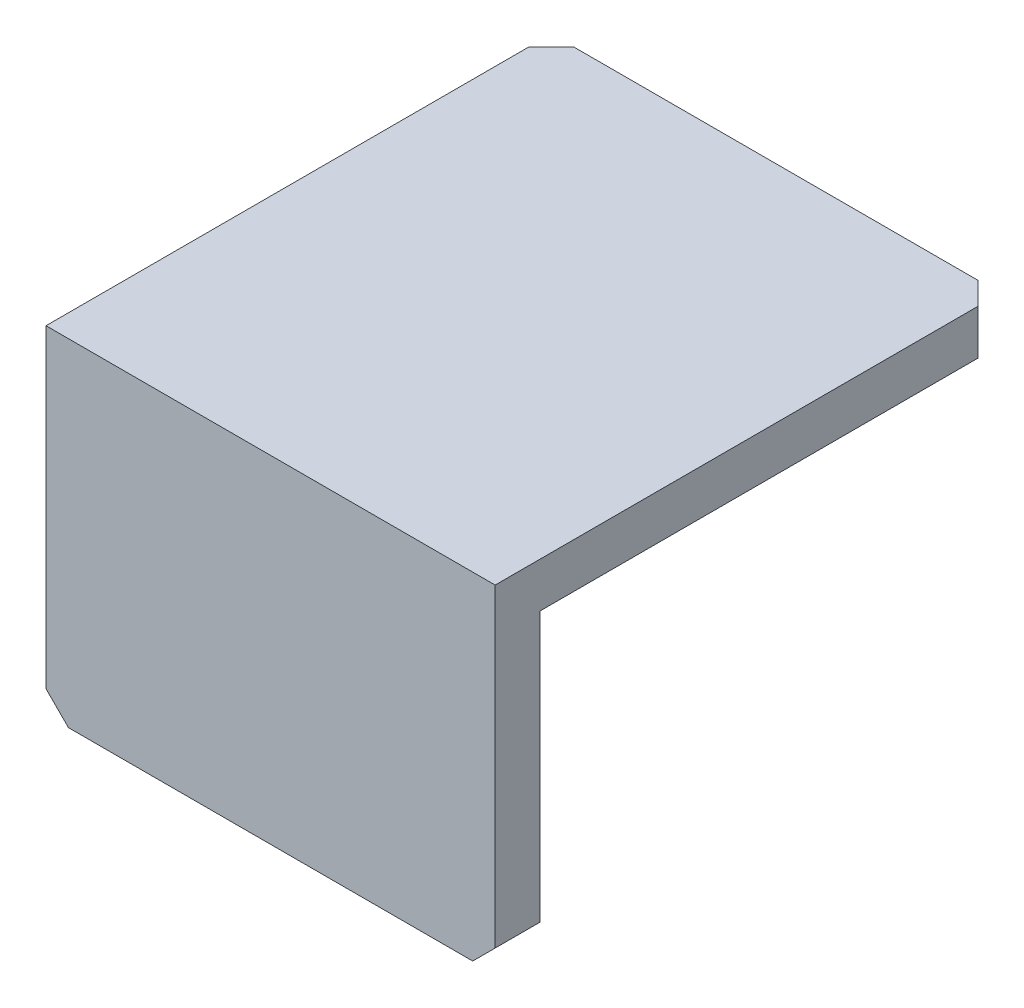
ISO-10303-21;
HEADER;
FILE_DESCRIPTION(('STEP AP214'),'2;1');
FILE_NAME('part.step','',(''),(''),'','','');
FILE_SCHEMA(('AUTOMOTIVE_DESIGN { 1 0 10303 214 1 1 1 1 }'));
ENDSEC;
DATA;
#1=APPLICATION_CONTEXT('core data for automotive mechanical design processes');
#2=APPLICATION_PROTOCOL_DEFINITION('international standard','automotive_design',2000,#1);
#3=PRODUCT_CONTEXT('',#1,'mechanical');
#4=PRODUCT('Part','Part','',(#3));
#5=PRODUCT_RELATED_PRODUCT_CATEGORY('part','',(#4));
#6=PRODUCT_DEFINITION_FORMATION('','',#4);
#7=PRODUCT_DEFINITION_CONTEXT('part definition',#1,'design');
#8=PRODUCT_DEFINITION('design','',#6,#7);
#9=PRODUCT_DEFINITION_SHAPE('','',#8);
#10=(LENGTH_UNIT() NAMED_UNIT(*) SI_UNIT(.MILLI.,.METRE.));
#11=(NAMED_UNIT(*) PLANE_ANGLE_UNIT() SI_UNIT($,.RADIAN.));
#12=(NAMED_UNIT(*) SI_UNIT($,.STERADIAN.) SOLID_ANGLE_UNIT());
#13=UNCERTAINTY_MEASURE_WITH_UNIT(LENGTH_MEASURE(1.E-05),#10,'distance_accuracy_value','');
#14=(GEOMETRIC_REPRESENTATION_CONTEXT(3) GLOBAL_UNCERTAINTY_ASSIGNED_CONTEXT((#13)) GLOBAL_UNIT_ASSIGNED_CONTEXT((#10,
#11,#12)) REPRESENTATION_CONTEXT('',''));
#15=CARTESIAN_POINT('',(0.,0.,0.));
#16=DIRECTION('',(0.,0.,1.));
#17=DIRECTION('',(1.,0.,0.));
#18=AXIS2_PLACEMENT_3D('',#15,#16,#17);
#19=CARTESIAN_POINT('',(-20.,-15.,45.));
#20=DIRECTION('',(1.,0.,0.));
#21=DIRECTION('',(0.,0.,-1.));
#22=AXIS2_PLACEMENT_3D('',#19,#20,#21);
#23=PLANE('',#22);
#24=DIRECTION('',(0.,1.,0.));
#25=VECTOR('',#24,1.);
#26=CARTESIAN_POINT('',(-20.,-15.,41.));
#27=LINE('',#26,#25);
#28=CARTESIAN_POINT('',(-20.,-13.,41.));
#29=VERTEX_POINT('',#28);
#30=CARTESIAN_POINT('',(-20.,11.,41.));
#31=VERTEX_POINT('',#30);
#32=EDGE_CURVE('E129',#29,#31,#27,.T.);
#33=ORIENTED_EDGE('',*,*,#32,.F.);
#34=DIRECTION('',(0.,0.,1.));
#35=VECTOR('',#34,1.);
#36=CARTESIAN_POINT('',(-20.,-13.,45.));
#37=LINE('',#36,#35);
#38=CARTESIAN_POINT('',(-20.,-13.,45.));
#39=VERTEX_POINT('',#38);
#40=EDGE_CURVE('E175',#29,#39,#37,.T.);
#41=ORIENTED_EDGE('',*,*,#40,.T.);
#42=DIRECTION('',(0.,-1.,0.));
#43=VECTOR('',#42,1.);
#44=CARTESIAN_POINT('',(-20.,-15.,45.));
#45=LINE('',#44,#43);
#46=CARTESIAN_POINT('',(-20.,15.,45.));
#47=VERTEX_POINT('',#46);
#48=EDGE_CURVE('E147',#47,#39,#45,.T.);
#49=ORIENTED_EDGE('',*,*,#48,.F.);
#50=DIRECTION('',(0.,0.,-1.));
#51=VECTOR('',#50,1.);
#52=CARTESIAN_POINT('',(-20.,15.,45.));
#53=LINE('',#52,#51);
#54=CARTESIAN_POINT('',(-20.,15.,2.00000000000002));
#55=VERTEX_POINT('',#54);
#56=EDGE_CURVE('E157',#47,#55,#53,.T.);
#57=ORIENTED_EDGE('',*,*,#56,.T.);
#58=DIRECTION('',(0.,-1.,0.));
#59=VECTOR('',#58,1.);
#60=CARTESIAN_POINT('',(-20.,-15.,2.));
#61=LINE('',#60,#59);
#62=CARTESIAN_POINT('',(-20.,11.,2.));
#63=VERTEX_POINT('',#62);
#64=EDGE_CURVE('E172',#55,#63,#61,.T.);
#65=ORIENTED_EDGE('',*,*,#64,.T.);
#66=DIRECTION('',(0.,0.,-1.));
#67=VECTOR('',#66,1.);
#68=CARTESIAN_POINT('',(-20.,11.,0.));
#69=LINE('',#68,#67);
#70=EDGE_CURVE('E122',#31,#63,#69,.T.);
#71=ORIENTED_EDGE('',*,*,#70,.F.);
#72=EDGE_LOOP('',(#33,#41,#49,#57,#65,#71));
#73=FACE_BOUND('',#72,.T.);
#74=ADVANCED_FACE('F34',(#73),#23,.F.);
#75=CARTESIAN_POINT('',(20.,-15.,45.));
#76=DIRECTION('',(0.,1.,0.));
#77=DIRECTION('',(-1.,0.,0.));
#78=AXIS2_PLACEMENT_3D('',#75,#76,#77);
#79=PLANE('',#78);
#80=DIRECTION('',(1.,0.,0.));
#81=VECTOR('',#80,1.);
#82=CARTESIAN_POINT('',(20.,-15.,45.));
#83=LINE('',#82,#81);
#84=CARTESIAN_POINT('',(-18.,-15.,45.));
#85=VERTEX_POINT('',#84);
#86=CARTESIAN_POINT('',(18.,-15.,45.));
#87=VERTEX_POINT('',#86);
#88=EDGE_CURVE('E150',#85,#87,#83,.T.);
#89=ORIENTED_EDGE('',*,*,#88,.F.);
#90=DIRECTION('',(0.,0.,-1.));
#91=VECTOR('',#90,1.);
#92=CARTESIAN_POINT('',(-18.,-15.,45.));
#93=LINE('',#92,#91);
#94=CARTESIAN_POINT('',(-18.,-15.,41.));
#95=VERTEX_POINT('',#94);
#96=EDGE_CURVE('E165',#85,#95,#93,.T.);
#97=ORIENTED_EDGE('',*,*,#96,.T.);
#98=DIRECTION('',(-1.,0.,0.));
#99=VECTOR('',#98,1.);
#100=CARTESIAN_POINT('',(20.,-15.,41.));
#101=LINE('',#100,#99);
#102=CARTESIAN_POINT('',(18.,-15.,41.));
#103=VERTEX_POINT('',#102);
#104=EDGE_CURVE('E134',#103,#95,#101,.T.);
#105=ORIENTED_EDGE('',*,*,#104,.F.);
#106=DIRECTION('',(0.,0.,1.));
#107=VECTOR('',#106,1.);
#108=CARTESIAN_POINT('',(18.,-15.,45.));
#109=LINE('',#108,#107);
#110=EDGE_CURVE('E163',#103,#87,#109,.T.);
#111=ORIENTED_EDGE('',*,*,#110,.T.);
#112=EDGE_LOOP('',(#89,#97,#105,#111));
#113=FACE_BOUND('',#112,.T.);
#114=ADVANCED_FACE('F207',(#113),#79,.F.);
#115=CARTESIAN_POINT('',(20.,-15.,45.));
#116=DIRECTION('',(-1.,0.,0.));
#117=DIRECTION('',(0.,0.,1.));
#118=AXIS2_PLACEMENT_3D('',#115,#116,#117);
#119=PLANE('',#118);
#120=DIRECTION('',(0.,1.,0.));
#121=VECTOR('',#120,1.);
#122=CARTESIAN_POINT('',(20.,-15.,45.));
#123=LINE('',#122,#121);
#124=CARTESIAN_POINT('',(20.,-13.,45.));
#125=VERTEX_POINT('',#124);
#126=CARTESIAN_POINT('',(20.,15.,45.));
#127=VERTEX_POINT('',#126);
#128=EDGE_CURVE('E153',#125,#127,#123,.T.);
#129=ORIENTED_EDGE('',*,*,#128,.F.);
#130=DIRECTION('',(0.,0.,-1.));
#131=VECTOR('',#130,1.);
#132=CARTESIAN_POINT('',(20.,-13.,45.));
#133=LINE('',#132,#131);
#134=CARTESIAN_POINT('',(20.,-13.,41.));
#135=VERTEX_POINT('',#134);
#136=EDGE_CURVE('E120',#125,#135,#133,.T.);
#137=ORIENTED_EDGE('',*,*,#136,.T.);
#138=DIRECTION('',(0.,1.,0.));
#139=VECTOR('',#138,1.);
#140=CARTESIAN_POINT('',(20.,-15.,41.));
#141=LINE('',#140,#139);
#142=CARTESIAN_POINT('',(20.,11.,41.));
#143=VERTEX_POINT('',#142);
#144=EDGE_CURVE('E111',#135,#143,#141,.T.);
#145=ORIENTED_EDGE('',*,*,#144,.T.);
#146=DIRECTION('',(0.,0.,-1.));
#147=VECTOR('',#146,1.);
#148=CARTESIAN_POINT('',(20.,11.,0.));
#149=LINE('',#148,#147);
#150=CARTESIAN_POINT('',(20.,11.,2.));
#151=VERTEX_POINT('',#150);
#152=EDGE_CURVE('E117',#143,#151,#149,.T.);
#153=ORIENTED_EDGE('',*,*,#152,.T.);
#154=DIRECTION('',(0.,1.,0.));
#155=VECTOR('',#154,1.);
#156=CARTESIAN_POINT('',(20.,-15.,2.));
#157=LINE('',#156,#155);
#158=CARTESIAN_POINT('',(20.,15.,2.00000000000002));
#159=VERTEX_POINT('',#158);
#160=EDGE_CURVE('E181',#151,#159,#157,.T.);
#161=ORIENTED_EDGE('',*,*,#160,.T.);
#162=DIRECTION('',(0.,0.,-1.));
#163=VECTOR('',#162,1.);
#164=CARTESIAN_POINT('',(20.,15.,45.));
#165=LINE('',#164,#163);
#166=EDGE_CURVE('E161',#127,#159,#165,.T.);
#167=ORIENTED_EDGE('',*,*,#166,.F.);
#168=EDGE_LOOP('',(#129,#137,#145,#153,#161,#167));
#169=FACE_BOUND('',#168,.T.);
#170=ADVANCED_FACE('F114',(#169),#119,.F.);
#171=CARTESIAN_POINT('',(20.,15.,45.));
#172=DIRECTION('',(0.,-1.,0.));
#173=DIRECTION('',(1.,0.,0.));
#174=AXIS2_PLACEMENT_3D('',#171,#172,#173);
#175=PLANE('',#174);
#176=DIRECTION('',(-1.,0.,0.));
#177=VECTOR('',#176,1.);
#178=CARTESIAN_POINT('',(20.,15.,0.));
#179=LINE('',#178,#177);
#180=CARTESIAN_POINT('',(18.,15.,0.));
#181=VERTEX_POINT('',#180);
#182=CARTESIAN_POINT('',(-18.,15.,0.));
#183=VERTEX_POINT('',#182);
#184=EDGE_CURVE('E145',#181,#183,#179,.T.);
#185=ORIENTED_EDGE('',*,*,#184,.T.);
#186=DIRECTION('',(0.707106781186549,0.,-0.707106781186546));
#187=VECTOR('',#186,1.);
#188=CARTESIAN_POINT('',(-20.,15.,2.));
#189=LINE('',#188,#187);
#190=EDGE_CURVE('E11',#183,#55,#189,.F.);
#191=ORIENTED_EDGE('',*,*,#190,.T.);
#192=ORIENTED_EDGE('',*,*,#56,.F.);
#193=DIRECTION('',(-1.,0.,0.));
#194=VECTOR('',#193,1.);
#195=CARTESIAN_POINT('',(20.,15.,45.));
#196=LINE('',#195,#194);
#197=EDGE_CURVE('E155',#127,#47,#196,.T.);
#198=ORIENTED_EDGE('',*,*,#197,.F.);
#199=ORIENTED_EDGE('',*,*,#166,.T.);
#200=DIRECTION('',(0.707106781186549,0.,0.707106781186546));
#201=VECTOR('',#200,1.);
#202=CARTESIAN_POINT('',(20.,15.,2.));
#203=LINE('',#202,#201);
#204=EDGE_CURVE('E42',#159,#181,#203,.F.);
#205=ORIENTED_EDGE('',*,*,#204,.T.);
#206=EDGE_LOOP('',(#185,#191,#192,#198,#199,#205));
#207=FACE_BOUND('',#206,.T.);
#208=ADVANCED_FACE('F194',(#207),#175,.F.);
#209=CARTESIAN_POINT('',(0.,0.,45.));
#210=DIRECTION('',(0.,0.,1.));
#211=DIRECTION('',(1.,0.,0.));
#212=AXIS2_PLACEMENT_3D('',#209,#210,#211);
#213=PLANE('',#212);
#214=ORIENTED_EDGE('',*,*,#48,.T.);
#215=DIRECTION('',(-0.707106781186546,0.707106781186549,0.));
#216=VECTOR('',#215,1.);
#217=CARTESIAN_POINT('',(-16.5,-16.5,45.));
#218=LINE('',#217,#216);
#219=EDGE_CURVE('E179',#39,#85,#218,.F.);
#220=ORIENTED_EDGE('',*,*,#219,.T.);
#221=ORIENTED_EDGE('',*,*,#88,.T.);
#222=DIRECTION('',(-0.70710678118655,-0.707106781186545,0.));
#223=VECTOR('',#222,1.);
#224=CARTESIAN_POINT('',(16.4999999999999,-16.5,45.));
#225=LINE('',#224,#223);
#226=EDGE_CURVE('E177',#87,#125,#225,.F.);
#227=ORIENTED_EDGE('',*,*,#226,.T.);
#228=ORIENTED_EDGE('',*,*,#128,.T.);
#229=ORIENTED_EDGE('',*,*,#197,.T.);
#230=EDGE_LOOP('',(#214,#220,#221,#227,#228,#229));
#231=FACE_BOUND('',#230,.T.);
#232=ADVANCED_FACE('F198',(#231),#213,.T.);
#233=CARTESIAN_POINT('',(0.,0.,0.));
#234=DIRECTION('',(0.,0.,1.));
#235=DIRECTION('',(1.,0.,0.));
#236=AXIS2_PLACEMENT_3D('',#233,#234,#235);
#237=PLANE('',#236);
#238=DIRECTION('',(-1.,0.,0.));
#239=VECTOR('',#238,1.);
#240=CARTESIAN_POINT('',(20.,11.,0.));
#241=LINE('',#240,#239);
#242=CARTESIAN_POINT('',(18.,11.,0.));
#243=VERTEX_POINT('',#242);
#244=CARTESIAN_POINT('',(-18.,11.,0.));
#245=VERTEX_POINT('',#244);
#246=EDGE_CURVE('E133',#243,#245,#241,.T.);
#247=ORIENTED_EDGE('',*,*,#246,.T.);
#248=DIRECTION('',(0.,1.,0.));
#249=VECTOR('',#248,1.);
#250=CARTESIAN_POINT('',(-18.,0.,0.));
#251=LINE('',#250,#249);
#252=EDGE_CURVE('E49',#245,#183,#251,.T.);
#253=ORIENTED_EDGE('',*,*,#252,.T.);
#254=ORIENTED_EDGE('',*,*,#184,.F.);
#255=DIRECTION('',(0.,-1.,0.));
#256=VECTOR('',#255,1.);
#257=CARTESIAN_POINT('',(18.,0.,0.));
#258=LINE('',#257,#256);
#259=EDGE_CURVE('E187',#181,#243,#258,.T.);
#260=ORIENTED_EDGE('',*,*,#259,.T.);
#261=EDGE_LOOP('',(#247,#253,#254,#260));
#262=FACE_BOUND('',#261,.T.);
#263=ADVANCED_FACE('F190',(#262),#237,.F.);
#264=CARTESIAN_POINT('',(20.,11.,0.));
#265=DIRECTION('',(0.,1.,0.));
#266=DIRECTION('',(0.,0.,1.));
#267=AXIS2_PLACEMENT_3D('',#264,#265,#266);
#268=PLANE('',#267);
#269=ORIENTED_EDGE('',*,*,#70,.T.);
#270=DIRECTION('',(-0.707106781186549,0.,0.707106781186546));
#271=VECTOR('',#270,1.);
#272=CARTESIAN_POINT('',(-20.,11.,2.));
#273=LINE('',#272,#271);
#274=EDGE_CURVE('E185',#63,#245,#273,.F.);
#275=ORIENTED_EDGE('',*,*,#274,.T.);
#276=ORIENTED_EDGE('',*,*,#246,.F.);
#277=DIRECTION('',(-0.707106781186549,0.,-0.707106781186546));
#278=VECTOR('',#277,1.);
#279=CARTESIAN_POINT('',(20.,11.,2.));
#280=LINE('',#279,#278);
#281=EDGE_CURVE('E139',#243,#151,#280,.F.);
#282=ORIENTED_EDGE('',*,*,#281,.T.);
#283=ORIENTED_EDGE('',*,*,#152,.F.);
#284=DIRECTION('',(-1.,0.,0.));
#285=VECTOR('',#284,1.);
#286=CARTESIAN_POINT('',(20.,11.,41.));
#287=LINE('',#286,#285);
#288=EDGE_CURVE('E125',#143,#31,#287,.T.);
#289=ORIENTED_EDGE('',*,*,#288,.T.);
#290=EDGE_LOOP('',(#269,#275,#276,#282,#283,#289));
#291=FACE_BOUND('',#290,.T.);
#292=ADVANCED_FACE('F136',(#291),#268,.F.);
#293=CARTESIAN_POINT('',(20.,-15.,41.));
#294=DIRECTION('',(0.,0.,1.));
#295=DIRECTION('',(1.,0.,0.));
#296=AXIS2_PLACEMENT_3D('',#293,#294,#295);
#297=PLANE('',#296);
#298=ORIENTED_EDGE('',*,*,#104,.T.);
#299=DIRECTION('',(0.707106781186546,-0.707106781186549,0.));
#300=VECTOR('',#299,1.);
#301=CARTESIAN_POINT('',(-18.,-15.,41.));
#302=LINE('',#301,#300);
#303=EDGE_CURVE('E170',#95,#29,#302,.F.);
#304=ORIENTED_EDGE('',*,*,#303,.T.);
#305=ORIENTED_EDGE('',*,*,#32,.T.);
#306=ORIENTED_EDGE('',*,*,#288,.F.);
#307=ORIENTED_EDGE('',*,*,#144,.F.);
#308=DIRECTION('',(0.70710678118655,0.707106781186545,0.));
#309=VECTOR('',#308,1.);
#310=CARTESIAN_POINT('',(20.,-13.,41.));
#311=LINE('',#310,#309);
#312=EDGE_CURVE('E168',#135,#103,#311,.F.);
#313=ORIENTED_EDGE('',*,*,#312,.T.);
#314=EDGE_LOOP('',(#298,#304,#305,#306,#307,#313));
#315=FACE_BOUND('',#314,.T.);
#316=ADVANCED_FACE('F127',(#315),#297,.F.);
#317=CARTESIAN_POINT('',(-18.,-15.,45.));
#318=DIRECTION('',(0.707106781186549,0.707106781186546,0.));
#319=DIRECTION('',(0.,0.,-1.));
#320=AXIS2_PLACEMENT_3D('',#317,#318,#319);
#321=PLANE('',#320);
#322=ORIENTED_EDGE('',*,*,#219,.F.);
#323=ORIENTED_EDGE('',*,*,#40,.F.);
#324=ORIENTED_EDGE('',*,*,#303,.F.);
#325=ORIENTED_EDGE('',*,*,#96,.F.);
#326=EDGE_LOOP('',(#322,#323,#324,#325));
#327=FACE_BOUND('',#326,.T.);
#328=ADVANCED_FACE('F210',(#327),#321,.F.);
#329=CARTESIAN_POINT('',(20.,-13.,45.));
#330=DIRECTION('',(-0.707106781186545,0.70710678118655,0.));
#331=DIRECTION('',(0.,0.,-1.));
#332=AXIS2_PLACEMENT_3D('',#329,#330,#331);
#333=PLANE('',#332);
#334=ORIENTED_EDGE('',*,*,#226,.F.);
#335=ORIENTED_EDGE('',*,*,#110,.F.);
#336=ORIENTED_EDGE('',*,*,#312,.F.);
#337=ORIENTED_EDGE('',*,*,#136,.F.);
#338=EDGE_LOOP('',(#334,#335,#336,#337));
#339=FACE_BOUND('',#338,.T.);
#340=ADVANCED_FACE('F202',(#339),#333,.F.);
#341=CARTESIAN_POINT('',(-20.,-15.,2.));
#342=DIRECTION('',(0.707106781186546,0.,0.707106781186549));
#343=DIRECTION('',(0.,-1.,0.));
#344=AXIS2_PLACEMENT_3D('',#341,#342,#343);
#345=PLANE('',#344);
#346=ORIENTED_EDGE('',*,*,#190,.F.);
#347=ORIENTED_EDGE('',*,*,#252,.F.);
#348=ORIENTED_EDGE('',*,*,#274,.F.);
#349=ORIENTED_EDGE('',*,*,#64,.F.);
#350=EDGE_LOOP('',(#346,#347,#348,#349));
#351=FACE_BOUND('',#350,.T.);
#352=ADVANCED_FACE('F216',(#351),#345,.F.);
#353=CARTESIAN_POINT('',(20.,-15.,2.));
#354=DIRECTION('',(-0.707106781186546,0.,0.707106781186549));
#355=DIRECTION('',(0.,1.,0.));
#356=AXIS2_PLACEMENT_3D('',#353,#354,#355);
#357=PLANE('',#356);
#358=ORIENTED_EDGE('',*,*,#281,.F.);
#359=ORIENTED_EDGE('',*,*,#259,.F.);
#360=ORIENTED_EDGE('',*,*,#204,.F.);
#361=ORIENTED_EDGE('',*,*,#160,.F.);
#362=EDGE_LOOP('',(#358,#359,#360,#361));
#363=FACE_BOUND('',#362,.T.);
#364=ADVANCED_FACE('F36',(#363),#357,.F.);
#365=CLOSED_SHELL('',(#74,#114,#170,#208,#232,#263,#292,#316,#328,#340,#352,#364));
#366=MANIFOLD_SOLID_BREP('B2',#365);
#367=ADVANCED_BREP_SHAPE_REPRESENTATION('',(#18,#366),#14);
#368=SHAPE_DEFINITION_REPRESENTATION(#9,#367);
ENDSEC;
END-ISO-10303-21;
